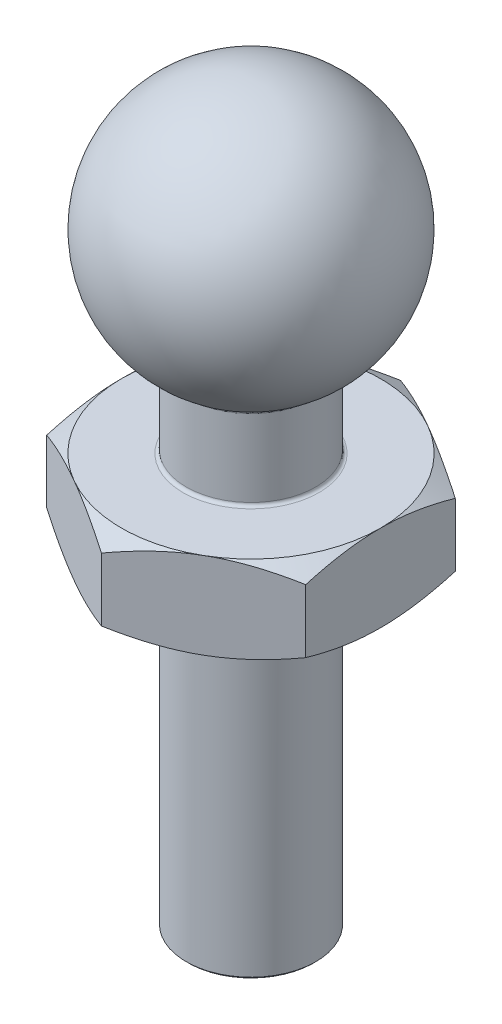
ISO-10303-21;
HEADER;
FILE_DESCRIPTION(('STEP AP214'),'2;1');
FILE_NAME('part.step','',(''),(''),'','','');
FILE_SCHEMA(('AUTOMOTIVE_DESIGN { 1 0 10303 214 1 1 1 1 }'));
ENDSEC;
DATA;
#1=APPLICATION_CONTEXT('core data for automotive mechanical design processes');
#2=APPLICATION_PROTOCOL_DEFINITION('international standard','automotive_design',2000,#1);
#3=PRODUCT_CONTEXT('',#1,'mechanical');
#4=PRODUCT('Part','Part','',(#3));
#5=PRODUCT_RELATED_PRODUCT_CATEGORY('part','',(#4));
#6=PRODUCT_DEFINITION_FORMATION('','',#4);
#7=PRODUCT_DEFINITION_CONTEXT('part definition',#1,'design');
#8=PRODUCT_DEFINITION('design','',#6,#7);
#9=PRODUCT_DEFINITION_SHAPE('','',#8);
#10=(LENGTH_UNIT() NAMED_UNIT(*) SI_UNIT(.MILLI.,.METRE.));
#11=(NAMED_UNIT(*) PLANE_ANGLE_UNIT() SI_UNIT($,.RADIAN.));
#12=(NAMED_UNIT(*) SI_UNIT($,.STERADIAN.) SOLID_ANGLE_UNIT());
#13=UNCERTAINTY_MEASURE_WITH_UNIT(LENGTH_MEASURE(1.E-05),#10,'distance_accuracy_value','');
#14=(GEOMETRIC_REPRESENTATION_CONTEXT(3) GLOBAL_UNCERTAINTY_ASSIGNED_CONTEXT((#13)) GLOBAL_UNIT_ASSIGNED_CONTEXT((#10,
#11,#12)) REPRESENTATION_CONTEXT('',''));
#15=CARTESIAN_POINT('',(0.,0.,0.));
#16=DIRECTION('',(0.,0.,1.));
#17=DIRECTION('',(1.,0.,0.));
#18=AXIS2_PLACEMENT_3D('',#15,#16,#17);
#19=CARTESIAN_POINT('',(0.,9.5,3.46410161513775));
#20=DIRECTION('',(-0.5,0.,-0.866025403784439));
#21=DIRECTION('',(-0.866025403784439,0.,0.5));
#22=AXIS2_PLACEMENT_3D('',#19,#20,#21);
#23=PLANE('',#22);
#24=CARTESIAN_POINT('',(-0.000200000000000219,9.23198413756899,3.46421708519159));
#25=CARTESIAN_POINT('',(0.131635206588331,9.27594629554769,3.38810199317915));
#26=CARTESIAN_POINT('',(0.264608405355249,9.31592841370737,3.31132988107606));
#27=CARTESIAN_POINT('',(0.532857420002056,9.38571791955454,3.15645624025988));
#28=CARTESIAN_POINT('',(0.668138002634342,9.41550061773462,3.078351959461));
#29=CARTESIAN_POINT('',(0.937022602096483,9.46186216078874,2.92311136358059));
#30=CARTESIAN_POINT('',(1.07058524542946,9.47874955887705,2.84599893549861));
#31=CARTESIAN_POINT('',(1.33833905729569,9.49891035755148,2.6914112001411));
#32=CARTESIAN_POINT('',(1.47252925247984,9.50220045221892,2.61393645482892));
#33=CARTESIAN_POINT('',(1.72327559769581,9.49535946911461,2.46916798492017));
#34=CARTESIAN_POINT('',(1.83986926497268,9.48690808580738,2.40185259973206));
#35=CARTESIAN_POINT('',(2.07229698497464,9.46012105699296,2.2676603930218));
#36=CARTESIAN_POINT('',(2.18813023365133,9.44177625913829,2.2007840357172));
#37=CARTESIAN_POINT('',(2.42103725705637,9.39591524914667,2.06631510305815));
#38=CARTESIAN_POINT('',(2.53808155051394,9.36820461473692,1.99873954872331));
#39=CARTESIAN_POINT('',(2.77042435049913,9.3053122048626,1.86459637060759));
#40=CARTESIAN_POINT('',(2.88572583417111,9.27014520897844,1.79802702797161));
#41=CARTESIAN_POINT('',(3.0002,9.23198413756899,1.73193533751504));
#42=B_SPLINE_CURVE_WITH_KNOTS('',3,(#24,#25,#26,#27,#28,#29,#30,#31,#32,#33,#34,#35,#36,#37,#38,
#39,#40,#41),.UNSPECIFIED.,.F.,.F.,(4,2,2,2,2,2,2,2,4),(0.,0.47553983010304,0.952222784107964,
1.41710776961288,1.88142182298026,2.28572436316091,2.69040156475039,3.10405572063576,
3.5168974940707),.UNSPECIFIED.);
#43=CARTESIAN_POINT('',(0.,9.23205080756888,3.46410161513775));
#44=VERTEX_POINT('',#43);
#45=CARTESIAN_POINT('',(1.5,9.5,2.59807621135332));
#46=VERTEX_POINT('',#45);
#47=EDGE_CURVE('E411',#44,#46,#42,.T.);
#48=ORIENTED_EDGE('',*,*,#47,.F.);
#49=DIRECTION('',(0.,-1.,0.));
#50=VECTOR('',#49,1.);
#51=CARTESIAN_POINT('',(0.,9.5,3.46410161513775));
#52=LINE('',#51,#50);
#53=CARTESIAN_POINT('',(0.,7.76794919243112,3.46410161513775));
#54=VERTEX_POINT('',#53);
#55=EDGE_CURVE('E264',#44,#54,#52,.T.);
#56=ORIENTED_EDGE('',*,*,#55,.T.);
#57=CARTESIAN_POINT('',(3.0002,7.76801586243101,1.73193533751504));
#58=CARTESIAN_POINT('',(2.86836479341167,7.72405370445231,1.80805042952748));
#59=CARTESIAN_POINT('',(2.73539159464475,7.68407158629263,1.88482254163057));
#60=CARTESIAN_POINT('',(2.46714257999794,7.61428208044547,2.03969618244675));
#61=CARTESIAN_POINT('',(2.33186199736566,7.58449938226538,2.11780046324563));
#62=CARTESIAN_POINT('',(2.06297739790352,7.53813783921126,2.27304105912605));
#63=CARTESIAN_POINT('',(1.92941475457054,7.52125044112295,2.35015348720802));
#64=CARTESIAN_POINT('',(1.66166094270431,7.50108964244852,2.50474122256554));
#65=CARTESIAN_POINT('',(1.52747074752016,7.49779954778108,2.58221596787771));
#66=CARTESIAN_POINT('',(1.27672440230419,7.50464053088539,2.72698443778647));
#67=CARTESIAN_POINT('',(1.16013073502732,7.51309191419262,2.79429982297457));
#68=CARTESIAN_POINT('',(0.927703015025363,7.53987894300703,2.92849202968483));
#69=CARTESIAN_POINT('',(0.811869766348669,7.55822374086171,2.99536838698943));
#70=CARTESIAN_POINT('',(0.578962742943633,7.60408475085333,3.12983731964848));
#71=CARTESIAN_POINT('',(0.461918449486059,7.63179538526308,3.19741287398332));
#72=CARTESIAN_POINT('',(0.229575649500875,7.6946877951374,3.33155605209904));
#73=CARTESIAN_POINT('',(0.114274165828894,7.72985479102155,3.39812539473502));
#74=CARTESIAN_POINT('',(-0.000199999999999861,7.76801586243101,3.46421708519159));
#75=B_SPLINE_CURVE_WITH_KNOTS('',3,(#57,#58,#59,#60,#61,#62,#63,#64,#65,#66,#67,#68,#69,#70,#71,
#72,#73,#74),.UNSPECIFIED.,.F.,.F.,(4,2,2,2,2,2,2,2,4),(0.,0.475539830103041,0.952222784107964,
1.41710776961288,1.88142182298026,2.28572436316091,2.69040156475039,3.10405572063576,
3.5168974940707),.UNSPECIFIED.);
#76=CARTESIAN_POINT('',(1.5,7.5,2.59807621135332));
#77=VERTEX_POINT('',#76);
#78=EDGE_CURVE('E243',#77,#54,#75,.T.);
#79=ORIENTED_EDGE('',*,*,#78,.F.);
#80=CARTESIAN_POINT('',(3.,7.76794919243112,1.73205080756888));
#81=VERTEX_POINT('',#80);
#82=EDGE_CURVE('E367',#81,#77,#75,.T.);
#83=ORIENTED_EDGE('',*,*,#82,.F.);
#84=DIRECTION('',(0.,-1.,0.));
#85=VECTOR('',#84,1.);
#86=CARTESIAN_POINT('',(3.,9.5,1.73205080756888));
#87=LINE('',#86,#85);
#88=CARTESIAN_POINT('',(3.,9.23205080756888,1.73205080756888));
#89=VERTEX_POINT('',#88);
#90=EDGE_CURVE('E273',#89,#81,#87,.T.);
#91=ORIENTED_EDGE('',*,*,#90,.F.);
#92=EDGE_CURVE('E139',#46,#89,#42,.T.);
#93=ORIENTED_EDGE('',*,*,#92,.F.);
#94=EDGE_LOOP('',(#48,#56,#79,#83,#91,#93));
#95=FACE_BOUND('',#94,.T.);
#96=ADVANCED_FACE('F46',(#95),#23,.F.);
#97=CARTESIAN_POINT('',(3.,9.5,1.73205080756888));
#98=DIRECTION('',(-1.,0.,0.));
#99=DIRECTION('',(0.,0.,1.));
#100=AXIS2_PLACEMENT_3D('',#97,#98,#99);
#101=PLANE('',#100);
#102=CARTESIAN_POINT('',(3.,7.49669275597267,5.73225080756888));
#103=CARTESIAN_POINT('',(3.,7.56535762873894,5.59799811373669));
#104=CARTESIAN_POINT('',(3.,7.63362658074956,5.46354106552018));
#105=CARTESIAN_POINT('',(3.,7.7691751977503,5.19412594711896));
#106=CARTESIAN_POINT('',(3.,7.83645484167597,5.05916786634262));
#107=CARTESIAN_POINT('',(3.,7.96993872408742,4.78843231789163));
#108=CARTESIAN_POINT('',(3.,8.0361409223391,4.65265384244875));
#109=CARTESIAN_POINT('',(3.,8.16708055525372,4.38038885038152));
#110=CARTESIAN_POINT('',(3.,8.23181796851999,4.24390232345015));
#111=CARTESIAN_POINT('',(3.,8.36273075239076,3.96310511366176));
#112=CARTESIAN_POINT('',(3.,8.42881132731156,3.81875010473635));
#113=CARTESIAN_POINT('',(3.,8.55842928727965,3.52890389215656));
#114=CARTESIAN_POINT('',(3.,8.62196674541402,3.38341272129836));
#115=CARTESIAN_POINT('',(3.,8.74573518476893,3.0911428032025));
#116=CARTESIAN_POINT('',(3.,8.80596844827941,2.94436502804428));
#117=CARTESIAN_POINT('',(3.,8.92221294586851,2.64909731827644));
#118=CARTESIAN_POINT('',(3.,8.97822314680859,2.50060697487877));
#119=CARTESIAN_POINT('',(3.,9.09420348606466,2.17495473766773));
#120=CARTESIAN_POINT('',(3.,9.15309774811246,1.99740334689548));
#121=CARTESIAN_POINT('',(3.,9.26029523419006,1.63917764376158));
#122=CARTESIAN_POINT('',(3.,9.30860404614459,1.45850503366086));
#123=CARTESIAN_POINT('',(3.,9.39023263279609,1.09720914532956));
#124=CARTESIAN_POINT('',(3.,9.42381477693698,0.916647599895758));
#125=CARTESIAN_POINT('',(3.,9.46126742176692,0.644079261802788));
#126=CARTESIAN_POINT('',(3.,9.47159787377878,0.552943422867094));
#127=CARTESIAN_POINT('',(3.,9.48763454600052,0.370270654947728));
#128=CARTESIAN_POINT('',(3.,9.49334144079801,0.27873378643531));
#129=CARTESIAN_POINT('',(3.,9.49996614854262,0.0944078517722087));
#130=CARTESIAN_POINT('',(3.,9.50082686163439,0.00161671746076017));
#131=CARTESIAN_POINT('',(3.,9.49757525562797,-0.183877598413801));
#132=CARTESIAN_POINT('',(3.,9.49346292019229,-0.276580779686968));
#133=CARTESIAN_POINT('',(3.,9.48041370767168,-0.461668088480514));
#134=CARTESIAN_POINT('',(3.,9.47147558711607,-0.554052127589443));
#135=CARTESIAN_POINT('',(3.,9.4490819835307,-0.738276464049773));
#136=CARTESIAN_POINT('',(3.,9.43562578745626,-0.830116673244043));
#137=CARTESIAN_POINT('',(3.,9.38848678345653,-1.1081241349506));
#138=CARTESIAN_POINT('',(3.,9.34831083516922,-1.29320289274649));
#139=CARTESIAN_POINT('',(3.,9.25483304091392,-1.65992833453579));
#140=CARTESIAN_POINT('',(3.,9.20152817481691,-1.8415742184766));
#141=CARTESIAN_POINT('',(3.,9.09001482170302,-2.18718321983853));
#142=CARTESIAN_POINT('',(3.,9.03254960886738,-2.35139002090273));
#143=CARTESIAN_POINT('',(3.,8.91157770593577,-2.67757637701535));
#144=CARTESIAN_POINT('',(3.,8.84806982210383,-2.83955548471668));
#145=CARTESIAN_POINT('',(3.,8.71649668995848,-3.16180541641892));
#146=CARTESIAN_POINT('',(3.,8.64842746398323,-3.32207460435457));
#147=CARTESIAN_POINT('',(3.,8.50888164672137,-3.64112437712565));
#148=CARTESIAN_POINT('',(3.,8.43740489080743,-3.79990488959462));
#149=CARTESIAN_POINT('',(3.,8.29572041514807,-4.10783154121877));
#150=CARTESIAN_POINT('',(3.,8.22564804300012,-4.25704019529893));
#151=CARTESIAN_POINT('',(3.,8.0836551872923,-4.55457880885657));
#152=CARTESIAN_POINT('',(3.,8.01173465191384,-4.70290874355283));
#153=CARTESIAN_POINT('',(3.,7.8666308572428,-4.99841900754648));
#154=CARTESIAN_POINT('',(3.,7.79345182235509,-5.14560141584992));
#155=CARTESIAN_POINT('',(3.,7.64590152942625,-5.43935321353678));
#156=CARTESIAN_POINT('',(3.,7.57153036655204,-5.58592265068708));
#157=CARTESIAN_POINT('',(3.,7.49669275597267,-5.73225080756888));
#158=B_SPLINE_CURVE_WITH_KNOTS('',3,(#102,#103,#104,#105,#106,#107,#108,#109,#110,#111,#112,
#113,#114,#115,#116,#117,#118,#119,#120,#121,#122,#123,#124,#125,#126,#127,#128,#129,#130,#131,
#132,#133,#134,#135,#136,#137,#138,#139,#140,#141,#142,#143,#144,#145,#146,#147,#148,#149,#150,
#151,#152,#153,#154,#155,#156,#157),.UNSPECIFIED.,.F.,.F.,(4,2,2,2,2,2,2,2,2,2,2,2,2,2,2,2,2,2,
2,2,2,2,2,2,2,2,2,4),(0.,0.452382016001322,0.904773650265349,1.35794045354517,1.81111387213612,
2.2873771437625,2.76362671813268,3.23954308217786,3.71557550010852,4.27652369616462,
4.83717505756687,5.38738613645125,5.66244417939779,5.937462083513,6.21571369559987,
6.4939662218021,6.77229048018743,7.05065868449287,7.61810965270507,8.18569127741244,
8.70745206667822,9.2293161451901,9.75164138486645,10.2739918851653,10.7685068932809,
11.2630357817083,11.756143015984,12.2492110799155),.UNSPECIFIED.);
#159=CARTESIAN_POINT('',(3.,9.5,0.));
#160=VERTEX_POINT('',#159);
#161=EDGE_CURVE('E135',#89,#160,#158,.T.);
#162=ORIENTED_EDGE('',*,*,#161,.F.);
#163=ORIENTED_EDGE('',*,*,#90,.T.);
#164=CARTESIAN_POINT('',(3.,9.50330724402733,-5.73225080756888));
#165=CARTESIAN_POINT('',(3.,9.43464237126105,-5.59799811373669));
#166=CARTESIAN_POINT('',(3.,9.36637341925044,-5.46354106552018));
#167=CARTESIAN_POINT('',(3.,9.2308248022497,-5.19412594711896));
#168=CARTESIAN_POINT('',(3.,9.16354515832403,-5.05916786634262));
#169=CARTESIAN_POINT('',(3.,9.03006127591258,-4.78843231789163));
#170=CARTESIAN_POINT('',(3.,8.9638590776609,-4.65265384244875));
#171=CARTESIAN_POINT('',(3.,8.83291944474628,-4.38038885038152));
#172=CARTESIAN_POINT('',(3.,8.76818203148001,-4.24390232345015));
#173=CARTESIAN_POINT('',(3.,8.63726924760924,-3.96310511366176));
#174=CARTESIAN_POINT('',(3.,8.57118867268844,-3.81875010473635));
#175=CARTESIAN_POINT('',(3.,8.44157071272035,-3.52890389215656));
#176=CARTESIAN_POINT('',(3.,8.37803325458598,-3.38341272129836));
#177=CARTESIAN_POINT('',(3.,8.25426481523107,-3.0911428032025));
#178=CARTESIAN_POINT('',(3.,8.19403155172058,-2.94436502804428));
#179=CARTESIAN_POINT('',(3.,8.07778705413149,-2.64909731827644));
#180=CARTESIAN_POINT('',(3.,8.02177685319141,-2.50060697487877));
#181=CARTESIAN_POINT('',(3.,7.90579651393534,-2.17495473766773));
#182=CARTESIAN_POINT('',(3.,7.84690225188754,-1.99740334689548));
#183=CARTESIAN_POINT('',(3.,7.73970476580994,-1.63917764376158));
#184=CARTESIAN_POINT('',(3.,7.69139595385541,-1.45850503366086));
#185=CARTESIAN_POINT('',(3.,7.60976736720391,-1.09720914532956));
#186=CARTESIAN_POINT('',(3.,7.57618522306302,-0.916647599895755));
#187=CARTESIAN_POINT('',(3.,7.53873257823308,-0.644079261802785));
#188=CARTESIAN_POINT('',(3.,7.52840212622122,-0.552943422867092));
#189=CARTESIAN_POINT('',(3.,7.51236545399948,-0.370270654947725));
#190=CARTESIAN_POINT('',(3.,7.50665855920199,-0.278733786435307));
#191=CARTESIAN_POINT('',(3.,7.50003385145738,-0.0944078517722059));
#192=CARTESIAN_POINT('',(3.,7.4991731383656,-0.00161671746075764));
#193=CARTESIAN_POINT('',(3.,7.50242474437203,0.183877598413803));
#194=CARTESIAN_POINT('',(3.,7.50653707980771,0.276580779686971));
#195=CARTESIAN_POINT('',(3.,7.51958629232832,0.461668088480518));
#196=CARTESIAN_POINT('',(3.,7.52852441288393,0.554052127589446));
#197=CARTESIAN_POINT('',(3.,7.5509180164693,0.738276464049776));
#198=CARTESIAN_POINT('',(3.,7.56437421254374,0.830116673244046));
#199=CARTESIAN_POINT('',(3.,7.61151321654347,1.1081241349506));
#200=CARTESIAN_POINT('',(3.,7.65168916483078,1.2932028927465));
#201=CARTESIAN_POINT('',(3.,7.74516695908608,1.65992833453579));
#202=CARTESIAN_POINT('',(3.,7.7984718251831,1.8415742184766));
#203=CARTESIAN_POINT('',(3.,7.90998517829698,2.18718321983853));
#204=CARTESIAN_POINT('',(3.,7.96745039113262,2.35139002090274));
#205=CARTESIAN_POINT('',(3.,8.08842229406423,2.67757637701536));
#206=CARTESIAN_POINT('',(3.,8.15193017789617,2.83955548471668));
#207=CARTESIAN_POINT('',(3.,8.28350331004152,3.16180541641892));
#208=CARTESIAN_POINT('',(3.,8.35157253601678,3.32207460435457));
#209=CARTESIAN_POINT('',(3.,8.49111835327864,3.64112437712565));
#210=CARTESIAN_POINT('',(3.,8.56259510919258,3.79990488959462));
#211=CARTESIAN_POINT('',(3.,8.70427958485193,4.10783154121877));
#212=CARTESIAN_POINT('',(3.,8.77435195699988,4.25704019529893));
#213=CARTESIAN_POINT('',(3.,8.9163448127077,4.55457880885658));
#214=CARTESIAN_POINT('',(3.,8.98826534808616,4.70290874355283));
#215=CARTESIAN_POINT('',(3.,9.1333691427572,4.99841900754648));
#216=CARTESIAN_POINT('',(3.,9.20654817764491,5.14560141584992));
#217=CARTESIAN_POINT('',(3.,9.35409847057374,5.43935321353677));
#218=CARTESIAN_POINT('',(3.,9.42846963344796,5.58592265068707));
#219=CARTESIAN_POINT('',(3.,9.50330724402733,5.73225080756888));
#220=B_SPLINE_CURVE_WITH_KNOTS('',3,(#164,#165,#166,#167,#168,#169,#170,#171,#172,#173,#174,
#175,#176,#177,#178,#179,#180,#181,#182,#183,#184,#185,#186,#187,#188,#189,#190,#191,#192,#193,
#194,#195,#196,#197,#198,#199,#200,#201,#202,#203,#204,#205,#206,#207,#208,#209,#210,#211,#212,
#213,#214,#215,#216,#217,#218,#219),.UNSPECIFIED.,.F.,.F.,(4,2,2,2,2,2,2,2,2,2,2,2,2,2,2,2,2,2,
2,2,2,2,2,2,2,2,2,4),(0.,0.452382016001321,0.904773650265347,1.35794045354517,1.81111387213612,
2.2873771437625,2.76362671813268,3.23954308217786,3.71557550010853,4.27652369616462,
4.83717505756687,5.38738613645125,5.66244417939779,5.93746208351301,6.21571369559987,
6.49396622180211,6.77229048018743,7.05065868449288,7.61810965270508,8.18569127741244,
8.70745206667822,9.2293161451901,9.75164138486646,10.2739918851653,10.7685068932809,
11.2630357817083,11.756143015984,12.2492110799155),.UNSPECIFIED.);
#221=CARTESIAN_POINT('',(3.,7.5,0.));
#222=VERTEX_POINT('',#221);
#223=EDGE_CURVE('E240',#222,#81,#220,.T.);
#224=ORIENTED_EDGE('',*,*,#223,.F.);
#225=CARTESIAN_POINT('',(3.,7.76794919243112,-1.73205080756888));
#226=VERTEX_POINT('',#225);
#227=EDGE_CURVE('E255',#226,#222,#220,.T.);
#228=ORIENTED_EDGE('',*,*,#227,.F.);
#229=DIRECTION('',(0.,-1.,0.));
#230=VECTOR('',#229,1.);
#231=CARTESIAN_POINT('',(3.,9.5,-1.73205080756888));
#232=LINE('',#231,#230);
#233=CARTESIAN_POINT('',(3.,9.23205080756888,-1.73205080756888));
#234=VERTEX_POINT('',#233);
#235=EDGE_CURVE('E164',#234,#226,#232,.T.);
#236=ORIENTED_EDGE('',*,*,#235,.F.);
#237=EDGE_CURVE('E143',#160,#234,#158,.T.);
#238=ORIENTED_EDGE('',*,*,#237,.F.);
#239=EDGE_LOOP('',(#162,#163,#224,#228,#236,#238));
#240=FACE_BOUND('',#239,.T.);
#241=ADVANCED_FACE('F162',(#240),#101,.F.);
#242=CARTESIAN_POINT('',(3.,9.5,-1.73205080756888));
#243=DIRECTION('',(-0.5,0.,0.866025403784439));
#244=DIRECTION('',(0.866025403784439,0.,0.5));
#245=AXIS2_PLACEMENT_3D('',#242,#243,#244);
#246=PLANE('',#245);
#247=CARTESIAN_POINT('',(3.0002,9.23198413756899,-1.73193533751504));
#248=CARTESIAN_POINT('',(2.86836479341167,9.27594629554769,-1.80805042952748));
#249=CARTESIAN_POINT('',(2.73539159464475,9.31592841370737,-1.88482254163057));
#250=CARTESIAN_POINT('',(2.46714257999794,9.38571791955454,-2.03969618244675));
#251=CARTESIAN_POINT('',(2.33186199736566,9.41550061773462,-2.11780046324563));
#252=CARTESIAN_POINT('',(2.06297739790352,9.46186216078874,-2.27304105912605));
#253=CARTESIAN_POINT('',(1.92941475457054,9.47874955887705,-2.35015348720802));
#254=CARTESIAN_POINT('',(1.66166094270431,9.49891035755148,-2.50474122256554));
#255=CARTESIAN_POINT('',(1.52747074752016,9.50220045221892,-2.58221596787771));
#256=CARTESIAN_POINT('',(1.27672440230419,9.49535946911461,-2.72698443778647));
#257=CARTESIAN_POINT('',(1.16013073502732,9.48690808580738,-2.79429982297457));
#258=CARTESIAN_POINT('',(0.927703015025364,9.46012105699296,-2.92849202968483));
#259=CARTESIAN_POINT('',(0.811869766348669,9.44177625913829,-2.99536838698943));
#260=CARTESIAN_POINT('',(0.578962742943632,9.39591524914667,-3.12983731964848));
#261=CARTESIAN_POINT('',(0.461918449486059,9.36820461473692,-3.19741287398332));
#262=CARTESIAN_POINT('',(0.229575649500876,9.3053122048626,-3.33155605209904));
#263=CARTESIAN_POINT('',(0.114274165828894,9.27014520897844,-3.39812539473502));
#264=CARTESIAN_POINT('',(-0.000199999999999207,9.23198413756899,-3.46421708519159));
#265=B_SPLINE_CURVE_WITH_KNOTS('',3,(#247,#248,#249,#250,#251,#252,#253,#254,#255,#256,#257,
#258,#259,#260,#261,#262,#263,#264),.UNSPECIFIED.,.F.,.F.,(4,2,2,2,2,2,2,2,4),(0.,
0.475539830103041,0.952222784107964,1.41710776961288,1.88142182298026,2.28572436316091,
2.69040156475039,3.10405572063576,3.5168974940707),.UNSPECIFIED.);
#266=CARTESIAN_POINT('',(1.5,9.5,-2.59807621135332));
#267=VERTEX_POINT('',#266);
#268=EDGE_CURVE('E150',#234,#267,#265,.T.);
#269=ORIENTED_EDGE('',*,*,#268,.F.);
#270=ORIENTED_EDGE('',*,*,#235,.T.);
#271=CARTESIAN_POINT('',(-0.000199999999999138,7.76801586243101,-3.46421708519159));
#272=CARTESIAN_POINT('',(0.131635206588333,7.72405370445231,-3.38810199317915));
#273=CARTESIAN_POINT('',(0.26460840535525,7.68407158629263,-3.31132988107606));
#274=CARTESIAN_POINT('',(0.532857420002056,7.61428208044547,-3.15645624025988));
#275=CARTESIAN_POINT('',(0.668138002634342,7.58449938226538,-3.078351959461));
#276=CARTESIAN_POINT('',(0.937022602096484,7.53813783921126,-2.92311136358059));
#277=CARTESIAN_POINT('',(1.07058524542946,7.52125044112295,-2.84599893549861));
#278=CARTESIAN_POINT('',(1.33833905729569,7.50108964244852,-2.6914112001411));
#279=CARTESIAN_POINT('',(1.47252925247984,7.49779954778108,-2.61393645482892));
#280=CARTESIAN_POINT('',(1.72327559769581,7.50464053088539,-2.46916798492017));
#281=CARTESIAN_POINT('',(1.83986926497268,7.51309191419262,-2.40185259973206));
#282=CARTESIAN_POINT('',(2.07229698497464,7.53987894300703,-2.2676603930218));
#283=CARTESIAN_POINT('',(2.18813023365133,7.55822374086171,-2.2007840357172));
#284=CARTESIAN_POINT('',(2.42103725705637,7.60408475085333,-2.06631510305815));
#285=CARTESIAN_POINT('',(2.53808155051394,7.63179538526308,-1.99873954872331));
#286=CARTESIAN_POINT('',(2.77042435049913,7.6946877951374,-1.86459637060759));
#287=CARTESIAN_POINT('',(2.88572583417111,7.72985479102156,-1.79802702797161));
#288=CARTESIAN_POINT('',(3.0002,7.76801586243101,-1.73193533751504));
#289=B_SPLINE_CURVE_WITH_KNOTS('',3,(#271,#272,#273,#274,#275,#276,#277,#278,#279,#280,#281,
#282,#283,#284,#285,#286,#287,#288),.UNSPECIFIED.,.F.,.F.,(4,2,2,2,2,2,2,2,4),(0.,
0.47553983010304,0.952222784107964,1.41710776961288,1.88142182298026,2.28572436316091,
2.69040156475039,3.10405572063576,3.5168974940707),.UNSPECIFIED.);
#290=CARTESIAN_POINT('',(1.5,7.5,-2.59807621135332));
#291=VERTEX_POINT('',#290);
#292=EDGE_CURVE('E256',#291,#226,#289,.T.);
#293=ORIENTED_EDGE('',*,*,#292,.F.);
#294=CARTESIAN_POINT('',(0.,7.76794919243112,-3.46410161513775));
#295=VERTEX_POINT('',#294);
#296=EDGE_CURVE('E263',#295,#291,#289,.T.);
#297=ORIENTED_EDGE('',*,*,#296,.F.);
#298=DIRECTION('',(0.,-1.,0.));
#299=VECTOR('',#298,1.);
#300=CARTESIAN_POINT('',(0.,9.5,-3.46410161513775));
#301=LINE('',#300,#299);
#302=CARTESIAN_POINT('',(0.,9.23205080756888,-3.46410161513775));
#303=VERTEX_POINT('',#302);
#304=EDGE_CURVE('E270',#303,#295,#301,.T.);
#305=ORIENTED_EDGE('',*,*,#304,.F.);
#306=EDGE_CURVE('E165',#267,#303,#265,.T.);
#307=ORIENTED_EDGE('',*,*,#306,.F.);
#308=EDGE_LOOP('',(#269,#270,#293,#297,#305,#307));
#309=FACE_BOUND('',#308,.T.);
#310=ADVANCED_FACE('F227',(#309),#246,.F.);
#311=CARTESIAN_POINT('',(0.,9.5,-3.46410161513775));
#312=DIRECTION('',(0.5,0.,0.866025403784439));
#313=DIRECTION('',(0.866025403784439,0.,-0.5));
#314=AXIS2_PLACEMENT_3D('',#311,#312,#313);
#315=PLANE('',#314);
#316=CARTESIAN_POINT('',(0.000200000000000966,9.23198413756899,-3.46421708519159));
#317=CARTESIAN_POINT('',(-0.131635206588331,9.27594629554769,-3.38810199317915));
#318=CARTESIAN_POINT('',(-0.264608405355248,9.31592841370737,-3.31132988107606));
#319=CARTESIAN_POINT('',(-0.532857420002055,9.38571791955454,-3.15645624025988));
#320=CARTESIAN_POINT('',(-0.668138002634341,9.41550061773462,-3.078351959461));
#321=CARTESIAN_POINT('',(-0.937022602096482,9.46186216078874,-2.92311136358059));
#322=CARTESIAN_POINT('',(-1.07058524542946,9.47874955887705,-2.84599893549861));
#323=CARTESIAN_POINT('',(-1.33833905729569,9.49891035755148,-2.6914112001411));
#324=CARTESIAN_POINT('',(-1.47252925247984,9.50220045221892,-2.61393645482892));
#325=CARTESIAN_POINT('',(-1.72327559769581,9.49535946911461,-2.46916798492017));
#326=CARTESIAN_POINT('',(-1.83986926497267,9.48690808580738,-2.40185259973206));
#327=CARTESIAN_POINT('',(-2.07229698497464,9.46012105699296,-2.2676603930218));
#328=CARTESIAN_POINT('',(-2.18813023365133,9.44177625913829,-2.2007840357172));
#329=CARTESIAN_POINT('',(-2.42103725705637,9.39591524914667,-2.06631510305815));
#330=CARTESIAN_POINT('',(-2.53808155051394,9.36820461473692,-1.99873954872331));
#331=CARTESIAN_POINT('',(-2.77042435049912,9.3053122048626,-1.86459637060759));
#332=CARTESIAN_POINT('',(-2.88572583417111,9.27014520897844,-1.79802702797161));
#333=CARTESIAN_POINT('',(-3.0002,9.23198413756899,-1.73193533751504));
#334=B_SPLINE_CURVE_WITH_KNOTS('',3,(#316,#317,#318,#319,#320,#321,#322,#323,#324,#325,#326,
#327,#328,#329,#330,#331,#332,#333),.UNSPECIFIED.,.F.,.F.,(4,2,2,2,2,2,2,2,4),(0.,
0.475539830103041,0.952222784107964,1.41710776961288,1.88142182298026,2.28572436316091,
2.69040156475039,3.10405572063576,3.5168974940707),.UNSPECIFIED.);
#335=CARTESIAN_POINT('',(-1.5,9.5,-2.59807621135332));
#336=VERTEX_POINT('',#335);
#337=EDGE_CURVE('E221',#303,#336,#334,.T.);
#338=ORIENTED_EDGE('',*,*,#337,.F.);
#339=ORIENTED_EDGE('',*,*,#304,.T.);
#340=CARTESIAN_POINT('',(-3.0002,7.76801586243101,-1.73193533751504));
#341=CARTESIAN_POINT('',(-2.86836479341167,7.72405370445231,-1.80805042952748));
#342=CARTESIAN_POINT('',(-2.73539159464475,7.68407158629263,-1.88482254163057));
#343=CARTESIAN_POINT('',(-2.46714257999794,7.61428208044547,-2.03969618244675));
#344=CARTESIAN_POINT('',(-2.33186199736566,7.58449938226538,-2.11780046324563));
#345=CARTESIAN_POINT('',(-2.06297739790352,7.53813783921126,-2.27304105912605));
#346=CARTESIAN_POINT('',(-1.92941475457054,7.52125044112295,-2.35015348720802));
#347=CARTESIAN_POINT('',(-1.66166094270431,7.50108964244852,-2.50474122256554));
#348=CARTESIAN_POINT('',(-1.52747074752016,7.49779954778108,-2.58221596787771));
#349=CARTESIAN_POINT('',(-1.27672440230419,7.50464053088539,-2.72698443778647));
#350=CARTESIAN_POINT('',(-1.16013073502732,7.51309191419262,-2.79429982297457));
#351=CARTESIAN_POINT('',(-0.927703015025362,7.53987894300703,-2.92849202968483));
#352=CARTESIAN_POINT('',(-0.811869766348668,7.55822374086171,-2.99536838698943));
#353=CARTESIAN_POINT('',(-0.578962742943631,7.60408475085333,-3.12983731964849));
#354=CARTESIAN_POINT('',(-0.461918449486058,7.63179538526308,-3.19741287398332));
#355=CARTESIAN_POINT('',(-0.229575649500874,7.6946877951374,-3.33155605209904));
#356=CARTESIAN_POINT('',(-0.114274165828892,7.72985479102156,-3.39812539473502));
#357=CARTESIAN_POINT('',(0.000200000000001015,7.76801586243101,-3.46421708519159));
#358=B_SPLINE_CURVE_WITH_KNOTS('',3,(#340,#341,#342,#343,#344,#345,#346,#347,#348,#349,#350,
#351,#352,#353,#354,#355,#356,#357),.UNSPECIFIED.,.F.,.F.,(4,2,2,2,2,2,2,2,4),(0.,
0.475539830103041,0.952222784107964,1.41710776961288,1.88142182298026,2.28572436316091,
2.69040156475039,3.10405572063576,3.5168974940707),.UNSPECIFIED.);
#359=CARTESIAN_POINT('',(-1.5,7.5,-2.59807621135332));
#360=VERTEX_POINT('',#359);
#361=EDGE_CURVE('E242',#360,#295,#358,.T.);
#362=ORIENTED_EDGE('',*,*,#361,.F.);
#363=CARTESIAN_POINT('',(-3.,7.7679491924311,-1.73205080756891));
#364=VERTEX_POINT('',#363);
#365=EDGE_CURVE('E233',#364,#360,#358,.T.);
#366=ORIENTED_EDGE('',*,*,#365,.F.);
#367=DIRECTION('',(0.,-1.,0.));
#368=VECTOR('',#367,1.);
#369=CARTESIAN_POINT('',(-3.,9.5,-1.73205080756888));
#370=LINE('',#369,#368);
#371=CARTESIAN_POINT('',(-3.,9.23205080756888,-1.73205080756888));
#372=VERTEX_POINT('',#371);
#373=EDGE_CURVE('E268',#372,#364,#370,.T.);
#374=ORIENTED_EDGE('',*,*,#373,.F.);
#375=EDGE_CURVE('E215',#336,#372,#334,.T.);
#376=ORIENTED_EDGE('',*,*,#375,.F.);
#377=EDGE_LOOP('',(#338,#339,#362,#366,#374,#376));
#378=FACE_BOUND('',#377,.T.);
#379=ADVANCED_FACE('F223',(#378),#315,.F.);
#380=CARTESIAN_POINT('',(-3.,9.5,-1.73205080756888));
#381=DIRECTION('',(1.,0.,0.));
#382=DIRECTION('',(0.,0.,-1.));
#383=AXIS2_PLACEMENT_3D('',#380,#381,#382);
#384=PLANE('',#383);
#385=CARTESIAN_POINT('',(-3.,7.49669275597267,-5.73225080756888));
#386=CARTESIAN_POINT('',(-3.,7.56535762873895,-5.59799811373669));
#387=CARTESIAN_POINT('',(-3.,7.63362658074956,-5.46354106552017));
#388=CARTESIAN_POINT('',(-3.,7.7691751977503,-5.19412594711896));
#389=CARTESIAN_POINT('',(-3.,7.83645484167597,-5.05916786634262));
#390=CARTESIAN_POINT('',(-3.,7.96993872408742,-4.78843231789163));
#391=CARTESIAN_POINT('',(-3.,8.0361409223391,-4.65265384244874));
#392=CARTESIAN_POINT('',(-3.,8.16708055525372,-4.38038885038151));
#393=CARTESIAN_POINT('',(-3.,8.23181796851999,-4.24390232345014));
#394=CARTESIAN_POINT('',(-3.,8.36273075239076,-3.96310511366176));
#395=CARTESIAN_POINT('',(-3.,8.42881132731156,-3.81875010473635));
#396=CARTESIAN_POINT('',(-3.,8.55842928727965,-3.52890389215656));
#397=CARTESIAN_POINT('',(-3.,8.62196674541402,-3.38341272129836));
#398=CARTESIAN_POINT('',(-3.,8.74573518476893,-3.0911428032025));
#399=CARTESIAN_POINT('',(-3.,8.80596844827941,-2.94436502804428));
#400=CARTESIAN_POINT('',(-3.,8.92221294586851,-2.64909731827644));
#401=CARTESIAN_POINT('',(-3.,8.97822314680859,-2.50060697487877));
#402=CARTESIAN_POINT('',(-3.,9.09420348606466,-2.17495473766773));
#403=CARTESIAN_POINT('',(-3.,9.15309774811247,-1.99740334689548));
#404=CARTESIAN_POINT('',(-3.,9.26029523419006,-1.63917764376158));
#405=CARTESIAN_POINT('',(-3.,9.30860404614459,-1.45850503366086));
#406=CARTESIAN_POINT('',(-3.,9.39023263279609,-1.09720914532956));
#407=CARTESIAN_POINT('',(-3.,9.42381477693698,-0.916647599895756));
#408=CARTESIAN_POINT('',(-3.,9.46126742176692,-0.644079261802786));
#409=CARTESIAN_POINT('',(-3.,9.47159787377878,-0.552943422867093));
#410=CARTESIAN_POINT('',(-3.,9.48763454600052,-0.370270654947727));
#411=CARTESIAN_POINT('',(-3.,9.49334144079801,-0.278733786435308));
#412=CARTESIAN_POINT('',(-3.,9.49996614854262,-0.0944078517722074));
#413=CARTESIAN_POINT('',(-3.,9.50082686163439,-0.00161671746075914));
#414=CARTESIAN_POINT('',(-3.,9.49757525562797,0.183877598413802));
#415=CARTESIAN_POINT('',(-3.,9.49346292019229,0.276580779686969));
#416=CARTESIAN_POINT('',(-3.,9.48041370767168,0.461668088480516));
#417=CARTESIAN_POINT('',(-3.,9.47147558711607,0.554052127589444));
#418=CARTESIAN_POINT('',(-3.,9.4490819835307,0.738276464049775));
#419=CARTESIAN_POINT('',(-3.,9.43562578745626,0.830116673244044));
#420=CARTESIAN_POINT('',(-3.,9.38848678345653,1.1081241349506));
#421=CARTESIAN_POINT('',(-3.,9.34831083516922,1.29320289274649));
#422=CARTESIAN_POINT('',(-3.,9.25483304091392,1.65992833453579));
#423=CARTESIAN_POINT('',(-3.,9.20152817481691,1.8415742184766));
#424=CARTESIAN_POINT('',(-3.,9.09001482170302,2.18718321983853));
#425=CARTESIAN_POINT('',(-3.,9.03254960886738,2.35139002090274));
#426=CARTESIAN_POINT('',(-3.,8.91157770593576,2.67757637701536));
#427=CARTESIAN_POINT('',(-3.,8.84806982210383,2.83955548471668));
#428=CARTESIAN_POINT('',(-3.,8.71649668995848,3.16180541641892));
#429=CARTESIAN_POINT('',(-3.,8.64842746398323,3.32207460435457));
#430=CARTESIAN_POINT('',(-3.,8.50888164672137,3.64112437712565));
#431=CARTESIAN_POINT('',(-3.,8.43740489080743,3.79990488959462));
#432=CARTESIAN_POINT('',(-3.,8.29572041514807,4.10783154121877));
#433=CARTESIAN_POINT('',(-3.,8.22564804300012,4.25704019529893));
#434=CARTESIAN_POINT('',(-3.,8.0836551872923,4.55457880885657));
#435=CARTESIAN_POINT('',(-3.,8.01173465191385,4.70290874355283));
#436=CARTESIAN_POINT('',(-3.,7.86663085724281,4.99841900754647));
#437=CARTESIAN_POINT('',(-3.,7.79345182235509,5.14560141584992));
#438=CARTESIAN_POINT('',(-3.,7.64590152942626,5.43935321353677));
#439=CARTESIAN_POINT('',(-3.,7.57153036655204,5.58592265068707));
#440=CARTESIAN_POINT('',(-3.,7.49669275597267,5.73225080756888));
#441=B_SPLINE_CURVE_WITH_KNOTS('',3,(#385,#386,#387,#388,#389,#390,#391,#392,#393,#394,#395,
#396,#397,#398,#399,#400,#401,#402,#403,#404,#405,#406,#407,#408,#409,#410,#411,#412,#413,#414,
#415,#416,#417,#418,#419,#420,#421,#422,#423,#424,#425,#426,#427,#428,#429,#430,#431,#432,#433,
#434,#435,#436,#437,#438,#439,#440),.UNSPECIFIED.,.F.,.F.,(4,2,2,2,2,2,2,2,2,2,2,2,2,2,2,2,2,2,
2,2,2,2,2,2,2,2,2,4),(0.,0.452382016001322,0.904773650265349,1.35794045354517,1.81111387213612,
2.2873771437625,2.76362671813268,3.23954308217786,3.71557550010852,4.27652369616462,
4.83717505756687,5.38738613645125,5.66244417939779,5.937462083513,6.21571369559986,
6.4939662218021,6.77229048018743,7.05065868449287,7.61810965270507,8.18569127741243,
8.70745206667822,9.2293161451901,9.75164138486645,10.2739918851653,10.7685068932809,
11.2630357817083,11.756143015984,12.2492110799155),.UNSPECIFIED.);
#442=CARTESIAN_POINT('',(-3.,9.5,0.));
#443=VERTEX_POINT('',#442);
#444=EDGE_CURVE('E222',#372,#443,#441,.T.);
#445=ORIENTED_EDGE('',*,*,#444,.F.);
#446=ORIENTED_EDGE('',*,*,#373,.T.);
#447=CARTESIAN_POINT('',(-3.,9.50330724402733,5.73225080756888));
#448=CARTESIAN_POINT('',(-3.,9.43464237126105,5.59799811373669));
#449=CARTESIAN_POINT('',(-3.,9.36637341925044,5.46354106552017));
#450=CARTESIAN_POINT('',(-3.,9.2308248022497,5.19412594711896));
#451=CARTESIAN_POINT('',(-3.,9.16354515832403,5.05916786634262));
#452=CARTESIAN_POINT('',(-3.,9.03006127591258,4.78843231789163));
#453=CARTESIAN_POINT('',(-3.,8.9638590776609,4.65265384244875));
#454=CARTESIAN_POINT('',(-3.,8.83291944474628,4.38038885038151));
#455=CARTESIAN_POINT('',(-3.,8.76818203148001,4.24390232345014));
#456=CARTESIAN_POINT('',(-3.,8.63726924760924,3.96310511366176));
#457=CARTESIAN_POINT('',(-3.,8.57118867268844,3.81875010473635));
#458=CARTESIAN_POINT('',(-3.,8.44157071272035,3.52890389215656));
#459=CARTESIAN_POINT('',(-3.,8.37803325458598,3.38341272129836));
#460=CARTESIAN_POINT('',(-3.,8.25426481523107,3.0911428032025));
#461=CARTESIAN_POINT('',(-3.,8.19403155172058,2.94436502804428));
#462=CARTESIAN_POINT('',(-3.,8.07778705413149,2.64909731827644));
#463=CARTESIAN_POINT('',(-3.,8.02177685319141,2.50060697487877));
#464=CARTESIAN_POINT('',(-3.,7.90579651393534,2.17495473766773));
#465=CARTESIAN_POINT('',(-3.,7.84690225188754,1.99740334689548));
#466=CARTESIAN_POINT('',(-3.,7.73970476580994,1.63917764376158));
#467=CARTESIAN_POINT('',(-3.,7.69139595385541,1.45850503366086));
#468=CARTESIAN_POINT('',(-3.,7.60976736720391,1.09720914532956));
#469=CARTESIAN_POINT('',(-3.,7.57618522306302,0.916647599895755));
#470=CARTESIAN_POINT('',(-3.,7.53873257823308,0.644079261802785));
#471=CARTESIAN_POINT('',(-3.,7.52840212622122,0.552943422867092));
#472=CARTESIAN_POINT('',(-3.,7.51236545399948,0.370270654947726));
#473=CARTESIAN_POINT('',(-3.,7.50665855920199,0.278733786435307));
#474=CARTESIAN_POINT('',(-3.,7.50003385145738,0.0944078517722066));
#475=CARTESIAN_POINT('',(-3.,7.4991731383656,0.00161671746075801));
#476=CARTESIAN_POINT('',(-3.,7.50242474437203,-0.183877598413803));
#477=CARTESIAN_POINT('',(-3.,7.50653707980771,-0.27658077968697));
#478=CARTESIAN_POINT('',(-3.,7.51958629232832,-0.461668088480517));
#479=CARTESIAN_POINT('',(-3.,7.52852441288393,-0.554052127589445));
#480=CARTESIAN_POINT('',(-3.,7.5509180164693,-0.738276464049775));
#481=CARTESIAN_POINT('',(-3.,7.56437421254374,-0.830116673244045));
#482=CARTESIAN_POINT('',(-3.,7.61151321654347,-1.1081241349506));
#483=CARTESIAN_POINT('',(-3.,7.65168916483078,-1.29320289274649));
#484=CARTESIAN_POINT('',(-3.,7.74516695908608,-1.65992833453579));
#485=CARTESIAN_POINT('',(-3.,7.79847182518309,-1.8415742184766));
#486=CARTESIAN_POINT('',(-3.,7.90998517829698,-2.18718321983853));
#487=CARTESIAN_POINT('',(-3.,7.96745039113262,-2.35139002090274));
#488=CARTESIAN_POINT('',(-3.,8.08842229406423,-2.67757637701536));
#489=CARTESIAN_POINT('',(-3.,8.15193017789617,-2.83955548471668));
#490=CARTESIAN_POINT('',(-3.,8.28350331004152,-3.16180541641892));
#491=CARTESIAN_POINT('',(-3.,8.35157253601677,-3.32207460435457));
#492=CARTESIAN_POINT('',(-3.,8.49111835327863,-3.64112437712565));
#493=CARTESIAN_POINT('',(-3.,8.56259510919257,-3.79990488959462));
#494=CARTESIAN_POINT('',(-3.,8.70427958485193,-4.10783154121877));
#495=CARTESIAN_POINT('',(-3.,8.77435195699988,-4.25704019529893));
#496=CARTESIAN_POINT('',(-3.,8.9163448127077,-4.55457880885657));
#497=CARTESIAN_POINT('',(-3.,8.98826534808616,-4.70290874355283));
#498=CARTESIAN_POINT('',(-3.,9.13336914275719,-4.99841900754648));
#499=CARTESIAN_POINT('',(-3.,9.20654817764491,-5.14560141584992));
#500=CARTESIAN_POINT('',(-3.,9.35409847057374,-5.43935321353677));
#501=CARTESIAN_POINT('',(-3.,9.42846963344796,-5.58592265068707));
#502=CARTESIAN_POINT('',(-3.,9.50330724402733,-5.73225080756888));
#503=B_SPLINE_CURVE_WITH_KNOTS('',3,(#447,#448,#449,#450,#451,#452,#453,#454,#455,#456,#457,
#458,#459,#460,#461,#462,#463,#464,#465,#466,#467,#468,#469,#470,#471,#472,#473,#474,#475,#476,
#477,#478,#479,#480,#481,#482,#483,#484,#485,#486,#487,#488,#489,#490,#491,#492,#493,#494,#495,
#496,#497,#498,#499,#500,#501,#502),.UNSPECIFIED.,.F.,.F.,(4,2,2,2,2,2,2,2,2,2,2,2,2,2,2,2,2,2,
2,2,2,2,2,2,2,2,2,4),(0.,0.452382016001321,0.904773650265347,1.35794045354517,1.81111387213612,
2.2873771437625,2.76362671813267,3.23954308217786,3.71557550010852,4.27652369616462,
4.83717505756687,5.38738613645124,5.66244417939779,5.937462083513,6.21571369559986,
6.4939662218021,6.77229048018743,7.05065868449287,7.61810965270507,8.18569127741243,
8.70745206667822,9.2293161451901,9.75164138486645,10.2739918851653,10.7685068932809,
11.2630357817083,11.756143015984,12.2492110799155),.UNSPECIFIED.);
#504=CARTESIAN_POINT('',(-3.,7.5,0.));
#505=VERTEX_POINT('',#504);
#506=EDGE_CURVE('E241',#505,#364,#503,.T.);
#507=ORIENTED_EDGE('',*,*,#506,.F.);
#508=CARTESIAN_POINT('',(-3.,7.76794919243112,1.73205080756888));
#509=VERTEX_POINT('',#508);
#510=EDGE_CURVE('E371',#509,#505,#503,.T.);
#511=ORIENTED_EDGE('',*,*,#510,.F.);
#512=DIRECTION('',(0.,-1.,0.));
#513=VECTOR('',#512,1.);
#514=CARTESIAN_POINT('',(-3.,9.5,1.73205080756888));
#515=LINE('',#514,#513);
#516=CARTESIAN_POINT('',(-3.,9.23205080756888,1.73205080756888));
#517=VERTEX_POINT('',#516);
#518=EDGE_CURVE('E266',#517,#509,#515,.T.);
#519=ORIENTED_EDGE('',*,*,#518,.F.);
#520=EDGE_CURVE('E208',#443,#517,#441,.T.);
#521=ORIENTED_EDGE('',*,*,#520,.F.);
#522=EDGE_LOOP('',(#445,#446,#507,#511,#519,#521));
#523=FACE_BOUND('',#522,.T.);
#524=ADVANCED_FACE('F226',(#523),#384,.F.);
#525=CARTESIAN_POINT('',(-3.,9.5,1.73205080756888));
#526=DIRECTION('',(0.5,0.,-0.866025403784439));
#527=DIRECTION('',(-0.866025403784439,0.,-0.5));
#528=AXIS2_PLACEMENT_3D('',#525,#526,#527);
#529=PLANE('',#528);
#530=CARTESIAN_POINT('',(-3.0002,9.23198413756899,1.73193533751504));
#531=CARTESIAN_POINT('',(-2.86836479341167,9.27594629554769,1.80805042952748));
#532=CARTESIAN_POINT('',(-2.73539159464475,9.31592841370737,1.88482254163057));
#533=CARTESIAN_POINT('',(-2.46714257999794,9.38571791955454,2.03969618244675));
#534=CARTESIAN_POINT('',(-2.33186199736566,9.41550061773462,2.11780046324563));
#535=CARTESIAN_POINT('',(-2.06297739790352,9.46186216078875,2.27304105912604));
#536=CARTESIAN_POINT('',(-1.92941475457054,9.47874955887705,2.35015348720802));
#537=CARTESIAN_POINT('',(-1.66166094270431,9.49891035755148,2.50474122256553));
#538=CARTESIAN_POINT('',(-1.52747074752016,9.50220045221892,2.58221596787771));
#539=CARTESIAN_POINT('',(-1.27672440230419,9.49535946911461,2.72698443778646));
#540=CARTESIAN_POINT('',(-1.16013073502732,9.48690808580738,2.79429982297457));
#541=CARTESIAN_POINT('',(-0.927703015025364,9.46012105699297,2.92849202968483));
#542=CARTESIAN_POINT('',(-0.811869766348669,9.44177625913829,2.99536838698943));
#543=CARTESIAN_POINT('',(-0.578962742943633,9.39591524914667,3.12983731964848));
#544=CARTESIAN_POINT('',(-0.46191844948606,9.36820461473692,3.19741287398332));
#545=CARTESIAN_POINT('',(-0.229575649500876,9.3053122048626,3.33155605209904));
#546=CARTESIAN_POINT('',(-0.114274165828894,9.27014520897845,3.39812539473502));
#547=CARTESIAN_POINT('',(0.000200000000000084,9.23198413756899,3.46421708519159));
#548=B_SPLINE_CURVE_WITH_KNOTS('',3,(#530,#531,#532,#533,#534,#535,#536,#537,#538,#539,#540,
#541,#542,#543,#544,#545,#546,#547),.UNSPECIFIED.,.F.,.F.,(4,2,2,2,2,2,2,2,4),(0.,
0.475539830103041,0.952222784107964,1.41710776961288,1.88142182298026,2.28572436316091,
2.69040156475039,3.10405572063576,3.5168974940707),.UNSPECIFIED.);
#549=CARTESIAN_POINT('',(-1.5,9.5,2.59807621135332));
#550=VERTEX_POINT('',#549);
#551=EDGE_CURVE('E429',#517,#550,#548,.T.);
#552=ORIENTED_EDGE('',*,*,#551,.F.);
#553=ORIENTED_EDGE('',*,*,#518,.T.);
#554=CARTESIAN_POINT('',(0.0002,7.76801586243101,3.46421708519159));
#555=CARTESIAN_POINT('',(-0.131635206588331,7.7240537044523,3.38810199317915));
#556=CARTESIAN_POINT('',(-0.264608405355249,7.68407158629263,3.31132988107606));
#557=CARTESIAN_POINT('',(-0.532857420002055,7.61428208044547,3.15645624025988));
#558=CARTESIAN_POINT('',(-0.668138002634341,7.58449938226538,3.078351959461));
#559=CARTESIAN_POINT('',(-0.937022602096482,7.53813783921126,2.92311136358059));
#560=CARTESIAN_POINT('',(-1.07058524542946,7.52125044112295,2.84599893549861));
#561=CARTESIAN_POINT('',(-1.33833905729569,7.50108964244852,2.6914112001411));
#562=CARTESIAN_POINT('',(-1.47252925247984,7.49779954778108,2.61393645482892));
#563=CARTESIAN_POINT('',(-1.72327559769581,7.50464053088539,2.46916798492017));
#564=CARTESIAN_POINT('',(-1.83986926497267,7.51309191419262,2.40185259973206));
#565=CARTESIAN_POINT('',(-2.07229698497464,7.53987894300703,2.2676603930218));
#566=CARTESIAN_POINT('',(-2.18813023365133,7.55822374086171,2.2007840357172));
#567=CARTESIAN_POINT('',(-2.42103725705637,7.60408475085333,2.06631510305815));
#568=CARTESIAN_POINT('',(-2.53808155051394,7.63179538526308,1.99873954872331));
#569=CARTESIAN_POINT('',(-2.77042435049912,7.6946877951374,1.86459637060759));
#570=CARTESIAN_POINT('',(-2.88572583417111,7.72985479102156,1.79802702797161));
#571=CARTESIAN_POINT('',(-3.0002,7.76801586243101,1.73193533751504));
#572=B_SPLINE_CURVE_WITH_KNOTS('',3,(#554,#555,#556,#557,#558,#559,#560,#561,#562,#563,#564,
#565,#566,#567,#568,#569,#570,#571),.UNSPECIFIED.,.F.,.F.,(4,2,2,2,2,2,2,2,4),(0.,
0.47553983010304,0.952222784107963,1.41710776961288,1.88142182298026,2.28572436316091,
2.69040156475039,3.10405572063576,3.5168974940707),.UNSPECIFIED.);
#573=CARTESIAN_POINT('',(-1.5,7.5,2.59807621135332));
#574=VERTEX_POINT('',#573);
#575=EDGE_CURVE('E378',#574,#509,#572,.T.);
#576=ORIENTED_EDGE('',*,*,#575,.F.);
#577=EDGE_CURVE('E372',#54,#574,#572,.T.);
#578=ORIENTED_EDGE('',*,*,#577,.F.);
#579=ORIENTED_EDGE('',*,*,#55,.F.);
#580=EDGE_CURVE('E159',#550,#44,#548,.T.);
#581=ORIENTED_EDGE('',*,*,#580,.F.);
#582=EDGE_LOOP('',(#552,#553,#576,#578,#579,#581));
#583=FACE_BOUND('',#582,.T.);
#584=ADVANCED_FACE('F409',(#583),#529,.F.);
#585=CARTESIAN_POINT('',(0.,7.5,0.));
#586=DIRECTION('',(0.,1.,0.));
#587=DIRECTION('',(0.,0.,-1.));
#588=AXIS2_PLACEMENT_3D('',#585,#586,#587);
#589=CONICAL_SURFACE('',#588,3.,1.0471975511966);
#590=ORIENTED_EDGE('',*,*,#78,.T.);
#591=ORIENTED_EDGE('',*,*,#577,.T.);
#592=CARTESIAN_POINT('',(0.,7.5,0.));
#593=DIRECTION('',(0.,1.,0.));
#594=DIRECTION('',(0.,0.,1.));
#595=AXIS2_PLACEMENT_3D('',#592,#593,#594);
#596=CIRCLE('',#595,3.);
#597=EDGE_CURVE('E285',#574,#77,#596,.T.);
#598=ORIENTED_EDGE('',*,*,#597,.T.);
#599=EDGE_LOOP('',(#590,#591,#598));
#600=FACE_BOUND('',#599,.T.);
#601=ADVANCED_FACE('F404',(#600),#589,.T.);
#602=ORIENTED_EDGE('',*,*,#510,.T.);
#603=EDGE_CURVE('E287',#505,#574,#596,.T.);
#604=ORIENTED_EDGE('',*,*,#603,.T.);
#605=ORIENTED_EDGE('',*,*,#575,.T.);
#606=EDGE_LOOP('',(#602,#604,#605));
#607=FACE_BOUND('',#606,.T.);
#608=ADVANCED_FACE('F407',(#607),#589,.T.);
#609=ORIENTED_EDGE('',*,*,#365,.T.);
#610=EDGE_CURVE('E391',#360,#505,#596,.T.);
#611=ORIENTED_EDGE('',*,*,#610,.T.);
#612=ORIENTED_EDGE('',*,*,#506,.T.);
#613=EDGE_LOOP('',(#609,#611,#612));
#614=FACE_BOUND('',#613,.T.);
#615=ADVANCED_FACE('F388',(#614),#589,.T.);
#616=ORIENTED_EDGE('',*,*,#296,.T.);
#617=EDGE_CURVE('E364',#291,#360,#596,.T.);
#618=ORIENTED_EDGE('',*,*,#617,.T.);
#619=ORIENTED_EDGE('',*,*,#361,.T.);
#620=EDGE_LOOP('',(#616,#618,#619));
#621=FACE_BOUND('',#620,.T.);
#622=ADVANCED_FACE('F194',(#621),#589,.T.);
#623=ORIENTED_EDGE('',*,*,#292,.T.);
#624=ORIENTED_EDGE('',*,*,#227,.T.);
#625=CARTESIAN_POINT('',(0.,7.5,0.));
#626=DIRECTION('',(0.,-1.,0.));
#627=DIRECTION('',(0.,0.,-1.));
#628=AXIS2_PLACEMENT_3D('',#625,#626,#627);
#629=CIRCLE('',#628,3.);
#630=EDGE_CURVE('E361',#291,#222,#629,.T.);
#631=ORIENTED_EDGE('',*,*,#630,.F.);
#632=EDGE_LOOP('',(#623,#624,#631));
#633=FACE_BOUND('',#632,.T.);
#634=ADVANCED_FACE('F402',(#633),#589,.T.);
#635=ORIENTED_EDGE('',*,*,#223,.T.);
#636=ORIENTED_EDGE('',*,*,#82,.T.);
#637=EDGE_CURVE('E288',#77,#222,#596,.T.);
#638=ORIENTED_EDGE('',*,*,#637,.T.);
#639=EDGE_LOOP('',(#635,#636,#638));
#640=FACE_BOUND('',#639,.T.);
#641=ADVANCED_FACE('F331',(#640),#589,.T.);
#642=CARTESIAN_POINT('',(0.,0.,0.));
#643=DIRECTION('',(0.,-1.,0.));
#644=DIRECTION('',(0.,0.,-1.));
#645=AXIS2_PLACEMENT_3D('',#642,#643,#644);
#646=PLANE('',#645);
#647=CARTESIAN_POINT('',(0.,0.,0.));
#648=DIRECTION('',(0.,-1.,0.));
#649=DIRECTION('',(0.,0.,-1.));
#650=AXIS2_PLACEMENT_3D('',#647,#648,#649);
#651=CIRCLE('',#650,1.45);
#652=CARTESIAN_POINT('',(0.,0.,-1.45));
#653=VERTEX_POINT('',#652);
#654=EDGE_CURVE('E279',#653,#653,#651,.T.);
#655=ORIENTED_EDGE('',*,*,#654,.T.);
#656=EDGE_LOOP('',(#655));
#657=FACE_BOUND('',#656,.T.);
#658=ADVANCED_FACE('F327',(#657),#646,.T.);
#659=CARTESIAN_POINT('',(0.,0.,0.));
#660=DIRECTION('',(0.,1.,0.));
#661=DIRECTION('',(0.,0.,1.));
#662=AXIS2_PLACEMENT_3D('',#659,#660,#661);
#663=CONICAL_SURFACE('',#662,1.45,0.785398163397455);
#664=CARTESIAN_POINT('',(0.,0.0499999999999977,0.));
#665=DIRECTION('',(0.,-1.,0.));
#666=DIRECTION('',(0.,0.,-1.));
#667=AXIS2_PLACEMENT_3D('',#664,#665,#666);
#668=CIRCLE('',#667,1.5);
#669=CARTESIAN_POINT('',(0.,0.0499999999999977,-1.5));
#670=VERTEX_POINT('',#669);
#671=EDGE_CURVE('E282',#670,#670,#668,.F.);
#672=ORIENTED_EDGE('',*,*,#671,.F.);
#673=EDGE_LOOP('',(#672));
#674=FACE_BOUND('',#673,.T.);
#675=ORIENTED_EDGE('',*,*,#654,.F.);
#676=EDGE_LOOP('',(#675));
#677=FACE_BOUND('',#676,.T.);
#678=ADVANCED_FACE('F330',(#674,#677),#663,.T.);
#679=CARTESIAN_POINT('',(0.,0.,0.));
#680=DIRECTION('',(0.,-1.,0.));
#681=DIRECTION('',(0.,0.,-1.));
#682=AXIS2_PLACEMENT_3D('',#679,#680,#681);
#683=CYLINDRICAL_SURFACE('',#682,1.5);
#684=ORIENTED_EDGE('',*,*,#671,.T.);
#685=EDGE_LOOP('',(#684));
#686=FACE_BOUND('',#685,.T.);
#687=CARTESIAN_POINT('',(0.,7.5,0.));
#688=DIRECTION('',(0.,1.,0.));
#689=DIRECTION('',(0.,0.,1.));
#690=AXIS2_PLACEMENT_3D('',#687,#688,#689);
#691=CIRCLE('',#690,1.5);
#692=CARTESIAN_POINT('',(0.,7.5,1.5));
#693=VERTEX_POINT('',#692);
#694=EDGE_CURVE('E275',#693,#693,#691,.F.);
#695=ORIENTED_EDGE('',*,*,#694,.T.);
#696=EDGE_LOOP('',(#695));
#697=FACE_BOUND('',#696,.T.);
#698=ADVANCED_FACE('F308',(#686,#697),#683,.T.);
#699=CARTESIAN_POINT('',(0.,7.5,0.));
#700=DIRECTION('',(0.,1.,0.));
#701=DIRECTION('',(0.,0.,1.));
#702=AXIS2_PLACEMENT_3D('',#699,#700,#701);
#703=PLANE('',#702);
#704=ORIENTED_EDGE('',*,*,#694,.F.);
#705=EDGE_LOOP('',(#704));
#706=FACE_BOUND('',#705,.T.);
#707=ORIENTED_EDGE('',*,*,#637,.F.);
#708=ORIENTED_EDGE('',*,*,#597,.F.);
#709=ORIENTED_EDGE('',*,*,#603,.F.);
#710=ORIENTED_EDGE('',*,*,#610,.F.);
#711=ORIENTED_EDGE('',*,*,#617,.F.);
#712=ORIENTED_EDGE('',*,*,#630,.T.);
#713=EDGE_LOOP('',(#707,#708,#709,#710,#711,#712));
#714=FACE_BOUND('',#713,.T.);
#715=ADVANCED_FACE('F192',(#706,#714),#703,.F.);
#716=CARTESIAN_POINT('',(0.,9.5,0.));
#717=DIRECTION('',(0.,-1.,0.));
#718=DIRECTION('',(0.,0.,1.));
#719=AXIS2_PLACEMENT_3D('',#716,#717,#718);
#720=CONICAL_SURFACE('',#719,3.,1.0471975511966);
#721=ORIENTED_EDGE('',*,*,#47,.T.);
#722=CARTESIAN_POINT('',(0.,9.5,0.));
#723=DIRECTION('',(0.,1.,0.));
#724=DIRECTION('',(0.,0.,1.));
#725=AXIS2_PLACEMENT_3D('',#722,#723,#724);
#726=CIRCLE('',#725,3.);
#727=EDGE_CURVE('E157',#550,#46,#726,.T.);
#728=ORIENTED_EDGE('',*,*,#727,.F.);
#729=ORIENTED_EDGE('',*,*,#580,.T.);
#730=EDGE_LOOP('',(#721,#728,#729));
#731=FACE_BOUND('',#730,.T.);
#732=ADVANCED_FACE('F187',(#731),#720,.T.);
#733=ORIENTED_EDGE('',*,*,#520,.T.);
#734=ORIENTED_EDGE('',*,*,#551,.T.);
#735=EDGE_CURVE('E69',#443,#550,#726,.T.);
#736=ORIENTED_EDGE('',*,*,#735,.F.);
#737=EDGE_LOOP('',(#733,#734,#736));
#738=FACE_BOUND('',#737,.T.);
#739=ADVANCED_FACE('F191',(#738),#720,.T.);
#740=ORIENTED_EDGE('',*,*,#375,.T.);
#741=ORIENTED_EDGE('',*,*,#444,.T.);
#742=EDGE_CURVE('E433',#336,#443,#726,.T.);
#743=ORIENTED_EDGE('',*,*,#742,.F.);
#744=EDGE_LOOP('',(#740,#741,#743));
#745=FACE_BOUND('',#744,.T.);
#746=ADVANCED_FACE('F434',(#745),#720,.T.);
#747=ORIENTED_EDGE('',*,*,#306,.T.);
#748=ORIENTED_EDGE('',*,*,#337,.T.);
#749=EDGE_CURVE('E155',#267,#336,#726,.T.);
#750=ORIENTED_EDGE('',*,*,#749,.F.);
#751=EDGE_LOOP('',(#747,#748,#750));
#752=FACE_BOUND('',#751,.T.);
#753=ADVANCED_FACE('F543',(#752),#720,.T.);
#754=ORIENTED_EDGE('',*,*,#237,.T.);
#755=ORIENTED_EDGE('',*,*,#268,.T.);
#756=EDGE_CURVE('E147',#160,#267,#726,.T.);
#757=ORIENTED_EDGE('',*,*,#756,.F.);
#758=EDGE_LOOP('',(#754,#755,#757));
#759=FACE_BOUND('',#758,.T.);
#760=ADVANCED_FACE('F148',(#759),#720,.T.);
#761=ORIENTED_EDGE('',*,*,#92,.T.);
#762=ORIENTED_EDGE('',*,*,#161,.T.);
#763=CARTESIAN_POINT('',(0.,9.5,0.));
#764=DIRECTION('',(0.,1.,0.));
#765=DIRECTION('',(0.,0.,1.));
#766=AXIS2_PLACEMENT_3D('',#763,#764,#765);
#767=CIRCLE('',#766,3.);
#768=EDGE_CURVE('E61',#46,#160,#767,.T.);
#769=ORIENTED_EDGE('',*,*,#768,.F.);
#770=EDGE_LOOP('',(#761,#762,#769));
#771=FACE_BOUND('',#770,.T.);
#772=ADVANCED_FACE('F137',(#771),#720,.T.);
#773=CARTESIAN_POINT('',(0.,14.,0.));
#774=DIRECTION('',(0.,-1.,0.));
#775=DIRECTION('',(1.,0.,0.));
#776=AXIS2_PLACEMENT_3D('',#773,#774,#775);
#777=SPHERICAL_SURFACE('',#776,3.);
#778=CARTESIAN_POINT('',(0.,11.4233926543914,0.));
#779=DIRECTION('',(0.,1.,0.));
#780=DIRECTION('',(0.,0.,1.));
#781=AXIS2_PLACEMENT_3D('',#778,#779,#780);
#782=CIRCLE('',#781,1.53658536585366);
#783=CARTESIAN_POINT('',(0.,11.4233926543914,1.53658536585366));
#784=VERTEX_POINT('',#783);
#785=EDGE_CURVE('E54',#784,#784,#782,.T.);
#786=ORIENTED_EDGE('',*,*,#785,.T.);
#787=EDGE_LOOP('',(#786));
#788=FACE_BOUND('',#787,.T.);
#789=ADVANCED_FACE('F297',(#788),#777,.T.);
#790=CARTESIAN_POINT('',(0.,11.3589774707511,0.));
#791=DIRECTION('',(0.,1.,0.));
#792=DIRECTION('',(0.,0.,1.));
#793=AXIS2_PLACEMENT_3D('',#790,#791,#792);
#794=CIRCLE('',#793,1.5);
#795=CARTESIAN_POINT('',(0.,11.3589774707511,1.5));
#796=VERTEX_POINT('',#795);
#797=EDGE_CURVE('E292',#796,#796,#794,.F.);
#798=ORIENTED_EDGE('',*,*,#797,.T.);
#799=EDGE_LOOP('',(#798));
#800=FACE_BOUND('',#799,.T.);
#801=CARTESIAN_POINT('',(0.,9.575,0.));
#802=DIRECTION('',(0.,1.,0.));
#803=DIRECTION('',(0.,0.,1.));
#804=AXIS2_PLACEMENT_3D('',#801,#802,#803);
#805=CIRCLE('',#804,1.5);
#806=CARTESIAN_POINT('',(0.,9.575,1.5));
#807=VERTEX_POINT('',#806);
#808=EDGE_CURVE('E154',#807,#807,#805,.T.);
#809=ORIENTED_EDGE('',*,*,#808,.T.);
#810=EDGE_LOOP('',(#809));
#811=FACE_BOUND('',#810,.T.);
#812=ADVANCED_FACE('F304',(#800,#811),#683,.T.);
#813=CARTESIAN_POINT('',(0.,9.5,0.));
#814=DIRECTION('',(0.,1.,0.));
#815=DIRECTION('',(0.,0.,1.));
#816=AXIS2_PLACEMENT_3D('',#813,#814,#815);
#817=PLANE('',#816);
#818=CARTESIAN_POINT('',(0.,9.5,0.));
#819=DIRECTION('',(0.,1.,0.));
#820=DIRECTION('',(0.,0.,1.));
#821=AXIS2_PLACEMENT_3D('',#818,#819,#820);
#822=CIRCLE('',#821,1.575);
#823=CARTESIAN_POINT('',(0.,9.5,1.575));
#824=VERTEX_POINT('',#823);
#825=EDGE_CURVE('E12',#824,#824,#822,.F.);
#826=ORIENTED_EDGE('',*,*,#825,.T.);
#827=EDGE_LOOP('',(#826));
#828=FACE_BOUND('',#827,.T.);
#829=ORIENTED_EDGE('',*,*,#727,.T.);
#830=ORIENTED_EDGE('',*,*,#768,.T.);
#831=ORIENTED_EDGE('',*,*,#756,.T.);
#832=ORIENTED_EDGE('',*,*,#749,.T.);
#833=ORIENTED_EDGE('',*,*,#742,.T.);
#834=ORIENTED_EDGE('',*,*,#735,.T.);
#835=EDGE_LOOP('',(#829,#830,#831,#832,#833,#834));
#836=FACE_BOUND('',#835,.T.);
#837=ADVANCED_FACE('F158',(#828,#836),#817,.T.);
#838=CARTESIAN_POINT('',(0.,11.3589774707511,0.));
#839=DIRECTION('',(0.,1.,0.));
#840=DIRECTION('',(0.,0.,1.));
#841=AXIS2_PLACEMENT_3D('',#838,#839,#840);
#842=TOROIDAL_SURFACE('',#841,1.575,0.075);
#843=ORIENTED_EDGE('',*,*,#785,.F.);
#844=EDGE_LOOP('',(#843));
#845=FACE_BOUND('',#844,.T.);
#846=ORIENTED_EDGE('',*,*,#797,.F.);
#847=EDGE_LOOP('',(#846));
#848=FACE_BOUND('',#847,.T.);
#849=ADVANCED_FACE('F299',(#845,#848),#842,.F.);
#850=CARTESIAN_POINT('',(0.,9.575,0.));
#851=DIRECTION('',(0.,1.,0.));
#852=DIRECTION('',(0.,0.,1.));
#853=AXIS2_PLACEMENT_3D('',#850,#851,#852);
#854=TOROIDAL_SURFACE('',#853,1.575,0.075);
#855=ORIENTED_EDGE('',*,*,#808,.F.);
#856=EDGE_LOOP('',(#855));
#857=FACE_BOUND('',#856,.T.);
#858=ORIENTED_EDGE('',*,*,#825,.F.);
#859=EDGE_LOOP('',(#858));
#860=FACE_BOUND('',#859,.T.);
#861=ADVANCED_FACE('F48',(#857,#860),#854,.F.);
#862=CLOSED_SHELL('',(#96,#241,#310,#379,#524,#584,#601,#608,#615,#622,#634,#641,#658,#678,#698,
#715,#732,#739,#746,#753,#760,#772,#789,#812,#837,#849,#861));
#863=MANIFOLD_SOLID_BREP('B2',#862);
#864=ADVANCED_BREP_SHAPE_REPRESENTATION('',(#18,#863),#14);
#865=SHAPE_DEFINITION_REPRESENTATION(#9,#864);
ENDSEC;
END-ISO-10303-21;
